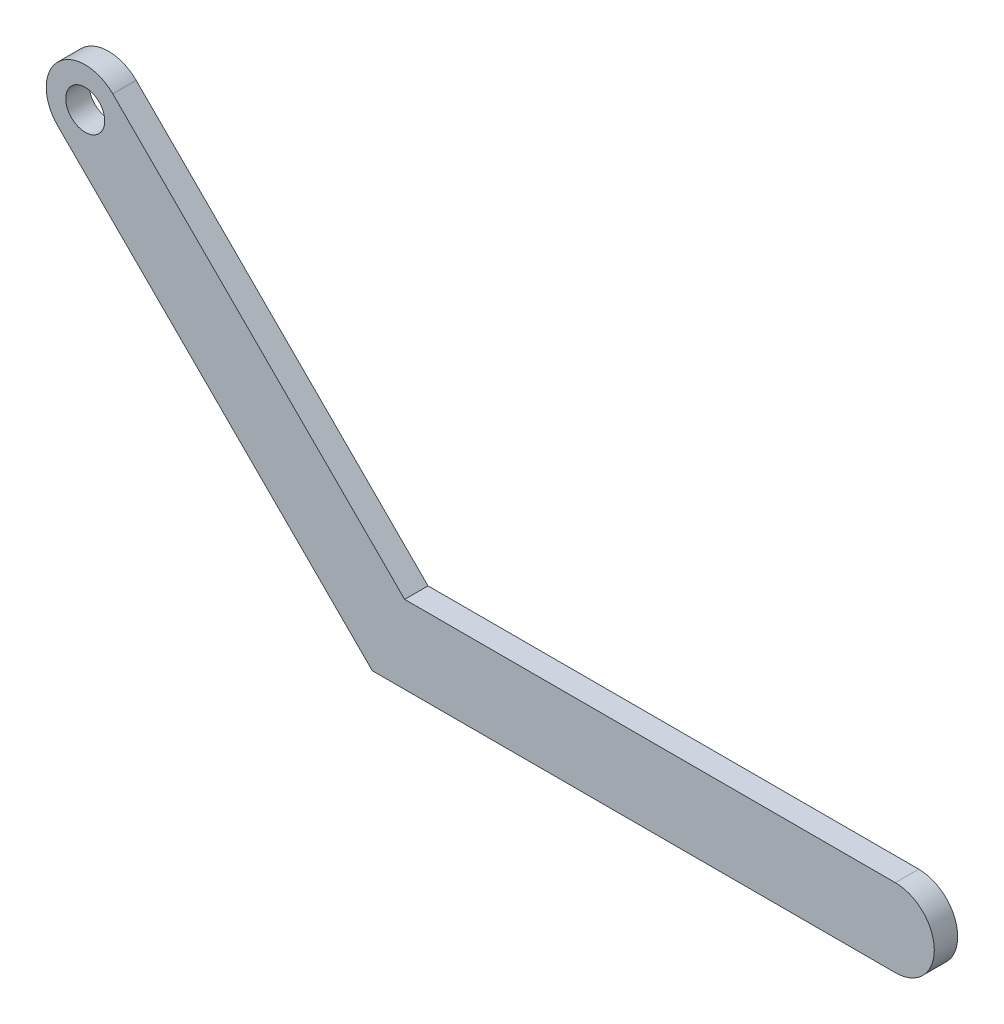
ISO-10303-21;
HEADER;
FILE_DESCRIPTION(('STEP AP214'),'2;1');
FILE_NAME('part.step','',(''),(''),'','','');
FILE_SCHEMA(('AUTOMOTIVE_DESIGN { 1 0 10303 214 1 1 1 1 }'));
ENDSEC;
DATA;
#1=APPLICATION_CONTEXT('core data for automotive mechanical design processes');
#2=APPLICATION_PROTOCOL_DEFINITION('international standard','automotive_design',2000,#1);
#3=PRODUCT_CONTEXT('',#1,'mechanical');
#4=PRODUCT('Part','Part','',(#3));
#5=PRODUCT_RELATED_PRODUCT_CATEGORY('part','',(#4));
#6=PRODUCT_DEFINITION_FORMATION('','',#4);
#7=PRODUCT_DEFINITION_CONTEXT('part definition',#1,'design');
#8=PRODUCT_DEFINITION('design','',#6,#7);
#9=PRODUCT_DEFINITION_SHAPE('','',#8);
#10=(LENGTH_UNIT() NAMED_UNIT(*) SI_UNIT(.MILLI.,.METRE.));
#11=(NAMED_UNIT(*) PLANE_ANGLE_UNIT() SI_UNIT($,.RADIAN.));
#12=(NAMED_UNIT(*) SI_UNIT($,.STERADIAN.) SOLID_ANGLE_UNIT());
#13=UNCERTAINTY_MEASURE_WITH_UNIT(LENGTH_MEASURE(1.E-05),#10,'distance_accuracy_value','');
#14=(GEOMETRIC_REPRESENTATION_CONTEXT(3) GLOBAL_UNCERTAINTY_ASSIGNED_CONTEXT((#13)) GLOBAL_UNIT_ASSIGNED_CONTEXT((#10,
#11,#12)) REPRESENTATION_CONTEXT('',''));
#15=CARTESIAN_POINT('',(0.,0.,0.));
#16=DIRECTION('',(0.,0.,1.));
#17=DIRECTION('',(1.,0.,0.));
#18=AXIS2_PLACEMENT_3D('',#15,#16,#17);
#19=CARTESIAN_POINT('',(2.07106781186546,5.,3.));
#20=DIRECTION('',(-0.707106781186544,-0.707106781186551,0.));
#21=DIRECTION('',(0.707106781186551,-0.707106781186544,0.));
#22=AXIS2_PLACEMENT_3D('',#19,#20,#21);
#23=PLANE('',#22);
#24=DIRECTION('',(-0.707106781186551,0.707106781186544,0.));
#25=VECTOR('',#24,1.);
#26=CARTESIAN_POINT('',(2.07106781186546,5.,0.));
#27=LINE('',#26,#25);
#28=CARTESIAN_POINT('',(2.07106781186546,5.,0.));
#29=VERTEX_POINT('',#28);
#30=CARTESIAN_POINT('',(-35.3553390593276,42.4264068711927,0.));
#31=VERTEX_POINT('',#30);
#32=EDGE_CURVE('E129',#29,#31,#27,.T.);
#33=ORIENTED_EDGE('',*,*,#32,.T.);
#34=DIRECTION('',(0.,0.,-1.));
#35=VECTOR('',#34,1.);
#36=CARTESIAN_POINT('',(-35.3553390593276,42.4264068711927,3.));
#37=LINE('',#36,#35);
#38=CARTESIAN_POINT('',(-35.3553390593276,42.4264068711927,3.));
#39=VERTEX_POINT('',#38);
#40=EDGE_CURVE('E11',#39,#31,#37,.T.);
#41=ORIENTED_EDGE('',*,*,#40,.F.);
#42=DIRECTION('',(-0.707106781186551,0.707106781186544,0.));
#43=VECTOR('',#42,1.);
#44=CARTESIAN_POINT('',(2.07106781186546,5.,3.));
#45=LINE('',#44,#43);
#46=CARTESIAN_POINT('',(2.07106781186546,5.,3.));
#47=VERTEX_POINT('',#46);
#48=EDGE_CURVE('E145',#47,#39,#45,.T.);
#49=ORIENTED_EDGE('',*,*,#48,.F.);
#50=DIRECTION('',(0.,0.,-1.));
#51=VECTOR('',#50,1.);
#52=CARTESIAN_POINT('',(2.07106781186546,5.,3.));
#53=LINE('',#52,#51);
#54=EDGE_CURVE('E125',#47,#29,#53,.T.);
#55=ORIENTED_EDGE('',*,*,#54,.T.);
#56=EDGE_LOOP('',(#33,#41,#49,#55));
#57=FACE_BOUND('',#56,.T.);
#58=ADVANCED_FACE('F39',(#57),#23,.F.);
#59=CARTESIAN_POINT('',(-38.8908729652603,38.8908729652599,3.));
#60=DIRECTION('',(0.,0.,-1.));
#61=DIRECTION('',(-1.,0.,0.));
#62=AXIS2_PLACEMENT_3D('',#59,#60,#61);
#63=CYLINDRICAL_SURFACE('',#62,5.);
#64=CARTESIAN_POINT('',(-38.8908729652603,38.8908729652599,0.));
#65=DIRECTION('',(0.,0.,1.));
#66=DIRECTION('',(1.,0.,0.));
#67=AXIS2_PLACEMENT_3D('',#64,#65,#66);
#68=CIRCLE('',#67,5.);
#69=CARTESIAN_POINT('',(-42.426406871193,35.3553390593272,0.));
#70=VERTEX_POINT('',#69);
#71=EDGE_CURVE('E133',#31,#70,#68,.T.);
#72=ORIENTED_EDGE('',*,*,#71,.T.);
#73=DIRECTION('',(0.,0.,-1.));
#74=VECTOR('',#73,1.);
#75=CARTESIAN_POINT('',(-42.426406871193,35.3553390593272,3.));
#76=LINE('',#75,#74);
#77=CARTESIAN_POINT('',(-42.426406871193,35.3553390593272,3.));
#78=VERTEX_POINT('',#77);
#79=EDGE_CURVE('E49',#78,#70,#76,.T.);
#80=ORIENTED_EDGE('',*,*,#79,.F.);
#81=CARTESIAN_POINT('',(-38.8908729652603,38.8908729652599,3.));
#82=DIRECTION('',(0.,0.,1.));
#83=DIRECTION('',(1.,0.,0.));
#84=AXIS2_PLACEMENT_3D('',#81,#82,#83);
#85=CIRCLE('',#84,5.);
#86=EDGE_CURVE('E94',#39,#78,#85,.T.);
#87=ORIENTED_EDGE('',*,*,#86,.F.);
#88=ORIENTED_EDGE('',*,*,#40,.T.);
#89=EDGE_LOOP('',(#72,#80,#87,#88));
#90=FACE_BOUND('',#89,.T.);
#91=ADVANCED_FACE('F175',(#90),#63,.T.);
#92=CARTESIAN_POINT('',(-2.07106781186546,-5.,3.));
#93=DIRECTION('',(0.707106781186544,0.707106781186551,0.));
#94=DIRECTION('',(-0.707106781186551,0.707106781186544,0.));
#95=AXIS2_PLACEMENT_3D('',#92,#93,#94);
#96=PLANE('',#95);
#97=DIRECTION('',(0.707106781186551,-0.707106781186544,0.));
#98=VECTOR('',#97,1.);
#99=CARTESIAN_POINT('',(-2.07106781186546,-5.,0.));
#100=LINE('',#99,#98);
#101=CARTESIAN_POINT('',(-2.07106781186546,-5.,0.));
#102=VERTEX_POINT('',#101);
#103=EDGE_CURVE('E136',#70,#102,#100,.T.);
#104=ORIENTED_EDGE('',*,*,#103,.T.);
#105=DIRECTION('',(0.,0.,-1.));
#106=VECTOR('',#105,1.);
#107=CARTESIAN_POINT('',(-2.07106781186546,-5.,3.));
#108=LINE('',#107,#106);
#109=CARTESIAN_POINT('',(-2.07106781186546,-5.,3.));
#110=VERTEX_POINT('',#109);
#111=EDGE_CURVE('E118',#110,#102,#108,.T.);
#112=ORIENTED_EDGE('',*,*,#111,.F.);
#113=DIRECTION('',(0.707106781186551,-0.707106781186544,0.));
#114=VECTOR('',#113,1.);
#115=CARTESIAN_POINT('',(-2.07106781186546,-5.,3.));
#116=LINE('',#115,#114);
#117=EDGE_CURVE('E107',#78,#110,#116,.T.);
#118=ORIENTED_EDGE('',*,*,#117,.F.);
#119=ORIENTED_EDGE('',*,*,#79,.T.);
#120=EDGE_LOOP('',(#104,#112,#118,#119));
#121=FACE_BOUND('',#120,.T.);
#122=ADVANCED_FACE('F156',(#121),#96,.F.);
#123=CARTESIAN_POINT('',(-2.07106781186546,-5.,3.));
#124=DIRECTION('',(0.,1.,0.));
#125=DIRECTION('',(0.,0.,1.));
#126=AXIS2_PLACEMENT_3D('',#123,#124,#125);
#127=PLANE('',#126);
#128=DIRECTION('',(1.,0.,0.));
#129=VECTOR('',#128,1.);
#130=CARTESIAN_POINT('',(-2.07106781186546,-5.,0.));
#131=LINE('',#130,#129);
#132=CARTESIAN_POINT('',(65.,-5.,0.));
#133=VERTEX_POINT('',#132);
#134=EDGE_CURVE('E116',#102,#133,#131,.T.);
#135=ORIENTED_EDGE('',*,*,#134,.T.);
#136=DIRECTION('',(0.,0.,-1.));
#137=VECTOR('',#136,1.);
#138=CARTESIAN_POINT('',(65.,-5.,3.));
#139=LINE('',#138,#137);
#140=CARTESIAN_POINT('',(65.,-5.,3.));
#141=VERTEX_POINT('',#140);
#142=EDGE_CURVE('E113',#141,#133,#139,.T.);
#143=ORIENTED_EDGE('',*,*,#142,.F.);
#144=DIRECTION('',(1.,0.,0.));
#145=VECTOR('',#144,1.);
#146=CARTESIAN_POINT('',(-2.07106781186546,-5.,3.));
#147=LINE('',#146,#145);
#148=EDGE_CURVE('E101',#110,#141,#147,.T.);
#149=ORIENTED_EDGE('',*,*,#148,.F.);
#150=ORIENTED_EDGE('',*,*,#111,.T.);
#151=EDGE_LOOP('',(#135,#143,#149,#150));
#152=FACE_BOUND('',#151,.T.);
#153=ADVANCED_FACE('F114',(#152),#127,.F.);
#154=CARTESIAN_POINT('',(65.,0.,3.));
#155=DIRECTION('',(0.,0.,-1.));
#156=DIRECTION('',(-1.,0.,0.));
#157=AXIS2_PLACEMENT_3D('',#154,#155,#156);
#158=CYLINDRICAL_SURFACE('',#157,5.);
#159=CARTESIAN_POINT('',(65.,0.,0.));
#160=DIRECTION('',(0.,0.,1.));
#161=DIRECTION('',(-1.,0.,0.));
#162=AXIS2_PLACEMENT_3D('',#159,#160,#161);
#163=CIRCLE('',#162,5.);
#164=CARTESIAN_POINT('',(65.,5.,0.));
#165=VERTEX_POINT('',#164);
#166=EDGE_CURVE('E80',#133,#165,#163,.T.);
#167=ORIENTED_EDGE('',*,*,#166,.T.);
#168=DIRECTION('',(0.,0.,-1.));
#169=VECTOR('',#168,1.);
#170=CARTESIAN_POINT('',(65.,5.,3.));
#171=LINE('',#170,#169);
#172=CARTESIAN_POINT('',(65.,5.,3.));
#173=VERTEX_POINT('',#172);
#174=EDGE_CURVE('E119',#173,#165,#171,.T.);
#175=ORIENTED_EDGE('',*,*,#174,.F.);
#176=CARTESIAN_POINT('',(65.,0.,3.));
#177=DIRECTION('',(0.,0.,1.));
#178=DIRECTION('',(-1.,0.,0.));
#179=AXIS2_PLACEMENT_3D('',#176,#177,#178);
#180=CIRCLE('',#179,5.);
#181=EDGE_CURVE('E105',#141,#173,#180,.T.);
#182=ORIENTED_EDGE('',*,*,#181,.F.);
#183=ORIENTED_EDGE('',*,*,#142,.T.);
#184=EDGE_LOOP('',(#167,#175,#182,#183));
#185=FACE_BOUND('',#184,.T.);
#186=ADVANCED_FACE('F121',(#185),#158,.T.);
#187=CARTESIAN_POINT('',(2.07106781186546,5.,3.));
#188=DIRECTION('',(0.,-1.,0.));
#189=DIRECTION('',(0.,0.,-1.));
#190=AXIS2_PLACEMENT_3D('',#187,#188,#189);
#191=PLANE('',#190);
#192=DIRECTION('',(-1.,0.,0.));
#193=VECTOR('',#192,1.);
#194=CARTESIAN_POINT('',(2.07106781186546,5.,0.));
#195=LINE('',#194,#193);
#196=EDGE_CURVE('E86',#165,#29,#195,.T.);
#197=ORIENTED_EDGE('',*,*,#196,.T.);
#198=ORIENTED_EDGE('',*,*,#54,.F.);
#199=DIRECTION('',(-1.,0.,0.));
#200=VECTOR('',#199,1.);
#201=CARTESIAN_POINT('',(2.07106781186546,5.,3.));
#202=LINE('',#201,#200);
#203=EDGE_CURVE('E57',#173,#47,#202,.T.);
#204=ORIENTED_EDGE('',*,*,#203,.F.);
#205=ORIENTED_EDGE('',*,*,#174,.T.);
#206=EDGE_LOOP('',(#197,#198,#204,#205));
#207=FACE_BOUND('',#206,.T.);
#208=ADVANCED_FACE('F163',(#207),#191,.F.);
#209=CARTESIAN_POINT('',(-38.8908729652603,38.8908729652599,3.));
#210=DIRECTION('',(0.,0.,1.));
#211=DIRECTION('',(1.,0.,0.));
#212=AXIS2_PLACEMENT_3D('',#209,#210,#211);
#213=PLANE('',#212);
#214=CARTESIAN_POINT('',(-38.8908729652603,38.8908729652599,3.));
#215=DIRECTION('',(0.,0.,1.));
#216=DIRECTION('',(1.,0.,0.));
#217=AXIS2_PLACEMENT_3D('',#214,#215,#216);
#218=CIRCLE('',#217,2.5);
#219=CARTESIAN_POINT('',(-36.3908729652603,38.8908729652599,3.));
#220=VERTEX_POINT('',#219);
#221=EDGE_CURVE('E228',#220,#220,#218,.T.);
#222=ORIENTED_EDGE('',*,*,#221,.F.);
#223=EDGE_LOOP('',(#222));
#224=FACE_BOUND('',#223,.T.);
#225=ORIENTED_EDGE('',*,*,#48,.T.);
#226=ORIENTED_EDGE('',*,*,#86,.T.);
#227=ORIENTED_EDGE('',*,*,#117,.T.);
#228=ORIENTED_EDGE('',*,*,#148,.T.);
#229=ORIENTED_EDGE('',*,*,#181,.T.);
#230=ORIENTED_EDGE('',*,*,#203,.T.);
#231=EDGE_LOOP('',(#225,#226,#227,#228,#229,#230));
#232=FACE_BOUND('',#231,.T.);
#233=ADVANCED_FACE('F103',(#224,#232),#213,.T.);
#234=CARTESIAN_POINT('',(-38.8908729652603,38.8908729652599,0.));
#235=DIRECTION('',(0.,0.,1.));
#236=DIRECTION('',(1.,0.,0.));
#237=AXIS2_PLACEMENT_3D('',#234,#235,#236);
#238=PLANE('',#237);
#239=CARTESIAN_POINT('',(-38.8908729652603,38.8908729652599,0.));
#240=DIRECTION('',(0.,0.,1.));
#241=DIRECTION('',(1.,0.,0.));
#242=AXIS2_PLACEMENT_3D('',#239,#240,#241);
#243=CIRCLE('',#242,2.5);
#244=CARTESIAN_POINT('',(-36.3908729652603,38.8908729652599,0.));
#245=VERTEX_POINT('',#244);
#246=EDGE_CURVE('E42',#245,#245,#243,.T.);
#247=ORIENTED_EDGE('',*,*,#246,.T.);
#248=EDGE_LOOP('',(#247));
#249=FACE_BOUND('',#248,.T.);
#250=ORIENTED_EDGE('',*,*,#32,.F.);
#251=ORIENTED_EDGE('',*,*,#196,.F.);
#252=ORIENTED_EDGE('',*,*,#166,.F.);
#253=ORIENTED_EDGE('',*,*,#134,.F.);
#254=ORIENTED_EDGE('',*,*,#103,.F.);
#255=ORIENTED_EDGE('',*,*,#71,.F.);
#256=EDGE_LOOP('',(#250,#251,#252,#253,#254,#255));
#257=FACE_BOUND('',#256,.T.);
#258=ADVANCED_FACE('F159',(#249,#257),#238,.F.);
#259=CARTESIAN_POINT('',(-38.8908729652603,38.8908729652599,-8.));
#260=DIRECTION('',(0.,0.,1.));
#261=DIRECTION('',(1.,0.,0.));
#262=AXIS2_PLACEMENT_3D('',#259,#260,#261);
#263=CYLINDRICAL_SURFACE('',#262,2.5);
#264=ORIENTED_EDGE('',*,*,#221,.T.);
#265=EDGE_LOOP('',(#264));
#266=FACE_BOUND('',#265,.T.);
#267=ORIENTED_EDGE('',*,*,#246,.F.);
#268=EDGE_LOOP('',(#267));
#269=FACE_BOUND('',#268,.T.);
#270=ADVANCED_FACE('F212',(#266,#269),#263,.F.);
#271=CLOSED_SHELL('',(#58,#91,#122,#153,#186,#208,#233,#258,#270));
#272=MANIFOLD_SOLID_BREP('B2',#271);
#273=ADVANCED_BREP_SHAPE_REPRESENTATION('',(#18,#272),#14);
#274=SHAPE_DEFINITION_REPRESENTATION(#9,#273);
ENDSEC;
END-ISO-10303-21;
